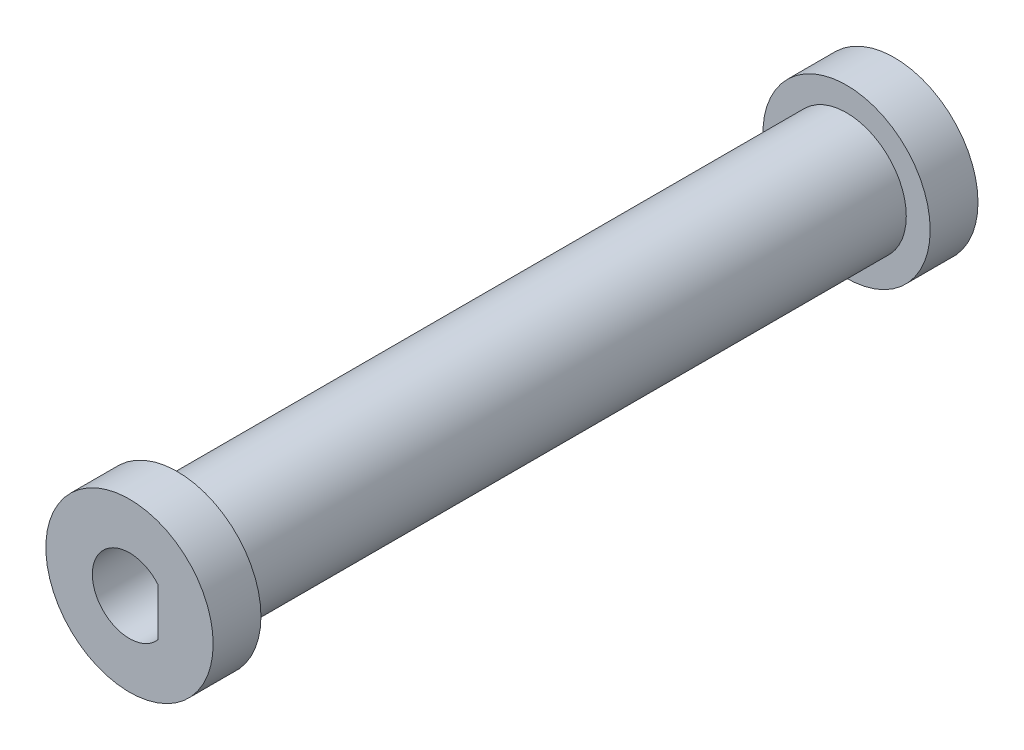
ISO-10303-21;
HEADER;
FILE_DESCRIPTION(('STEP AP214'),'2;1');
FILE_NAME('part.step','',(''),(''),'','','');
FILE_SCHEMA(('AUTOMOTIVE_DESIGN { 1 0 10303 214 1 1 1 1 }'));
ENDSEC;
DATA;
#1=APPLICATION_CONTEXT('core data for automotive mechanical design processes');
#2=APPLICATION_PROTOCOL_DEFINITION('international standard','automotive_design',2000,#1);
#3=PRODUCT_CONTEXT('',#1,'mechanical');
#4=PRODUCT('Part','Part','',(#3));
#5=PRODUCT_RELATED_PRODUCT_CATEGORY('part','',(#4));
#6=PRODUCT_DEFINITION_FORMATION('','',#4);
#7=PRODUCT_DEFINITION_CONTEXT('part definition',#1,'design');
#8=PRODUCT_DEFINITION('design','',#6,#7);
#9=PRODUCT_DEFINITION_SHAPE('','',#8);
#10=(LENGTH_UNIT() NAMED_UNIT(*) SI_UNIT(.MILLI.,.METRE.));
#11=(NAMED_UNIT(*) PLANE_ANGLE_UNIT() SI_UNIT($,.RADIAN.));
#12=(NAMED_UNIT(*) SI_UNIT($,.STERADIAN.) SOLID_ANGLE_UNIT());
#13=UNCERTAINTY_MEASURE_WITH_UNIT(LENGTH_MEASURE(1.E-05),#10,'distance_accuracy_value','');
#14=(GEOMETRIC_REPRESENTATION_CONTEXT(3) GLOBAL_UNCERTAINTY_ASSIGNED_CONTEXT((#13)) GLOBAL_UNIT_ASSIGNED_CONTEXT((#10,
#11,#12)) REPRESENTATION_CONTEXT('',''));
#15=CARTESIAN_POINT('',(0.,0.,0.));
#16=DIRECTION('',(0.,0.,1.));
#17=DIRECTION('',(1.,0.,0.));
#18=AXIS2_PLACEMENT_3D('',#15,#16,#17);
#19=CARTESIAN_POINT('',(0.,0.,38.1));
#20=DIRECTION('',(0.,0.,1.));
#21=DIRECTION('',(1.,0.,0.));
#22=AXIS2_PLACEMENT_3D('',#19,#20,#21);
#23=PLANE('',#22);
#24=CARTESIAN_POINT('',(0.,0.,38.1));
#25=DIRECTION('',(0.,0.,1.));
#26=DIRECTION('',(1.,0.,0.));
#27=AXIS2_PLACEMENT_3D('',#24,#25,#26);
#28=CIRCLE('',#27,4.445);
#29=CARTESIAN_POINT('',(4.445,0.,38.1));
#30=VERTEX_POINT('',#29);
#31=EDGE_CURVE('E46',#30,#30,#28,.T.);
#32=ORIENTED_EDGE('',*,*,#31,.T.);
#33=EDGE_LOOP('',(#32));
#34=FACE_BOUND('',#33,.T.);
#35=CARTESIAN_POINT('',(0.,0.,38.1));
#36=DIRECTION('',(0.,0.,1.));
#37=DIRECTION('',(1.,0.,0.));
#38=AXIS2_PLACEMENT_3D('',#35,#36,#37);
#39=CIRCLE('',#38,1.975);
#40=CARTESIAN_POINT('',(1.52499999999998,1.25499003980112,38.1));
#41=VERTEX_POINT('',#40);
#42=CARTESIAN_POINT('',(1.52499999999998,-1.25499003980109,38.1));
#43=VERTEX_POINT('',#42);
#44=EDGE_CURVE('E73',#41,#43,#39,.T.);
#45=ORIENTED_EDGE('',*,*,#44,.F.);
#46=DIRECTION('',(0.,-1.,0.));
#47=VECTOR('',#46,1.);
#48=CARTESIAN_POINT('',(1.52499999999998,0.,38.1));
#49=LINE('',#48,#47);
#50=EDGE_CURVE('E68',#41,#43,#49,.T.);
#51=ORIENTED_EDGE('',*,*,#50,.T.);
#52=EDGE_LOOP('',(#45,#51));
#53=FACE_BOUND('',#52,.T.);
#54=ADVANCED_FACE('F37',(#34,#53),#23,.T.);
#55=CARTESIAN_POINT('',(0.,0.,35.56));
#56=DIRECTION('',(0.,0.,-1.));
#57=DIRECTION('',(-1.,0.,0.));
#58=AXIS2_PLACEMENT_3D('',#55,#56,#57);
#59=CYLINDRICAL_SURFACE('',#58,3.175);
#60=CARTESIAN_POINT('',(0.,0.,35.56));
#61=DIRECTION('',(0.,0.,1.));
#62=DIRECTION('',(1.,0.,0.));
#63=AXIS2_PLACEMENT_3D('',#60,#61,#62);
#64=CIRCLE('',#63,3.175);
#65=CARTESIAN_POINT('',(3.175,0.,35.56));
#66=VERTEX_POINT('',#65);
#67=EDGE_CURVE('E11',#66,#66,#64,.T.);
#68=ORIENTED_EDGE('',*,*,#67,.F.);
#69=EDGE_LOOP('',(#68));
#70=FACE_BOUND('',#69,.T.);
#71=CARTESIAN_POINT('',(0.,0.,0.));
#72=DIRECTION('',(0.,0.,1.));
#73=DIRECTION('',(1.,0.,0.));
#74=AXIS2_PLACEMENT_3D('',#71,#72,#73);
#75=CIRCLE('',#74,3.175);
#76=CARTESIAN_POINT('',(3.175,0.,0.));
#77=VERTEX_POINT('',#76);
#78=EDGE_CURVE('E41',#77,#77,#75,.T.);
#79=ORIENTED_EDGE('',*,*,#78,.T.);
#80=EDGE_LOOP('',(#79));
#81=FACE_BOUND('',#80,.T.);
#82=ADVANCED_FACE('F39',(#70,#81),#59,.T.);
#83=CARTESIAN_POINT('',(0.,0.,38.1));
#84=DIRECTION('',(0.,0.,-1.));
#85=DIRECTION('',(-1.,0.,0.));
#86=AXIS2_PLACEMENT_3D('',#83,#84,#85);
#87=CYLINDRICAL_SURFACE('',#86,4.445);
#88=ORIENTED_EDGE('',*,*,#31,.F.);
#89=EDGE_LOOP('',(#88));
#90=FACE_BOUND('',#89,.T.);
#91=CARTESIAN_POINT('',(0.,0.,35.56));
#92=DIRECTION('',(0.,0.,1.));
#93=DIRECTION('',(1.,0.,0.));
#94=AXIS2_PLACEMENT_3D('',#91,#92,#93);
#95=CIRCLE('',#94,4.445);
#96=CARTESIAN_POINT('',(4.445,0.,35.56));
#97=VERTEX_POINT('',#96);
#98=EDGE_CURVE('E90',#97,#97,#95,.T.);
#99=ORIENTED_EDGE('',*,*,#98,.T.);
#100=EDGE_LOOP('',(#99));
#101=FACE_BOUND('',#100,.T.);
#102=ADVANCED_FACE('F116',(#90,#101),#87,.T.);
#103=CARTESIAN_POINT('',(0.,0.,35.56));
#104=DIRECTION('',(0.,0.,1.));
#105=DIRECTION('',(1.,0.,0.));
#106=AXIS2_PLACEMENT_3D('',#103,#104,#105);
#107=PLANE('',#106);
#108=ORIENTED_EDGE('',*,*,#67,.T.);
#109=EDGE_LOOP('',(#108));
#110=FACE_BOUND('',#109,.T.);
#111=ORIENTED_EDGE('',*,*,#98,.F.);
#112=EDGE_LOOP('',(#111));
#113=FACE_BOUND('',#112,.T.);
#114=ADVANCED_FACE('F107',(#110,#113),#107,.F.);
#115=CARTESIAN_POINT('',(0.,0.,-2.54));
#116=DIRECTION('',(0.,0.,1.));
#117=DIRECTION('',(1.,0.,0.));
#118=AXIS2_PLACEMENT_3D('',#115,#116,#117);
#119=CYLINDRICAL_SURFACE('',#118,4.445);
#120=CARTESIAN_POINT('',(0.,0.,-2.54));
#121=DIRECTION('',(0.,0.,1.));
#122=DIRECTION('',(1.,0.,0.));
#123=AXIS2_PLACEMENT_3D('',#120,#121,#122);
#124=CIRCLE('',#123,4.445);
#125=CARTESIAN_POINT('',(4.445,0.,-2.54));
#126=VERTEX_POINT('',#125);
#127=EDGE_CURVE('E83',#126,#126,#124,.T.);
#128=ORIENTED_EDGE('',*,*,#127,.T.);
#129=EDGE_LOOP('',(#128));
#130=FACE_BOUND('',#129,.T.);
#131=CARTESIAN_POINT('',(0.,0.,0.));
#132=DIRECTION('',(0.,0.,1.));
#133=DIRECTION('',(1.,0.,0.));
#134=AXIS2_PLACEMENT_3D('',#131,#132,#133);
#135=CIRCLE('',#134,4.445);
#136=CARTESIAN_POINT('',(4.445,0.,0.));
#137=VERTEX_POINT('',#136);
#138=EDGE_CURVE('E71',#137,#137,#135,.T.);
#139=ORIENTED_EDGE('',*,*,#138,.F.);
#140=EDGE_LOOP('',(#139));
#141=FACE_BOUND('',#140,.T.);
#142=ADVANCED_FACE('F105',(#130,#141),#119,.T.);
#143=CARTESIAN_POINT('',(0.,0.,-2.54));
#144=DIRECTION('',(0.,0.,-1.));
#145=DIRECTION('',(1.,0.,0.));
#146=AXIS2_PLACEMENT_3D('',#143,#144,#145);
#147=PLANE('',#146);
#148=ORIENTED_EDGE('',*,*,#127,.F.);
#149=EDGE_LOOP('',(#148));
#150=FACE_BOUND('',#149,.T.);
#151=ADVANCED_FACE('F101',(#150),#147,.T.);
#152=CARTESIAN_POINT('',(0.,0.,0.));
#153=DIRECTION('',(0.,0.,-1.));
#154=DIRECTION('',(1.,0.,0.));
#155=AXIS2_PLACEMENT_3D('',#152,#153,#154);
#156=PLANE('',#155);
#157=ORIENTED_EDGE('',*,*,#78,.F.);
#158=EDGE_LOOP('',(#157));
#159=FACE_BOUND('',#158,.T.);
#160=ORIENTED_EDGE('',*,*,#138,.T.);
#161=EDGE_LOOP('',(#160));
#162=FACE_BOUND('',#161,.T.);
#163=ADVANCED_FACE('F98',(#159,#162),#156,.F.);
#164=CARTESIAN_POINT('',(1.52499999999998,0.,27.94));
#165=DIRECTION('',(-1.,0.,0.));
#166=DIRECTION('',(0.,0.,1.));
#167=AXIS2_PLACEMENT_3D('',#164,#165,#166);
#168=PLANE('',#167);
#169=ORIENTED_EDGE('',*,*,#50,.F.);
#170=DIRECTION('',(0.,0.,1.));
#171=VECTOR('',#170,1.);
#172=CARTESIAN_POINT('',(1.52499999999997,1.25499003980112,27.94));
#173=LINE('',#172,#171);
#174=CARTESIAN_POINT('',(1.52499999999997,1.25499003980112,27.94));
#175=VERTEX_POINT('',#174);
#176=EDGE_CURVE('E53',#175,#41,#173,.T.);
#177=ORIENTED_EDGE('',*,*,#176,.F.);
#178=DIRECTION('',(0.,1.,0.));
#179=VECTOR('',#178,1.);
#180=CARTESIAN_POINT('',(1.52499999999998,0.,27.94));
#181=LINE('',#180,#179);
#182=CARTESIAN_POINT('',(1.52499999999998,-1.25499003980109,27.94));
#183=VERTEX_POINT('',#182);
#184=EDGE_CURVE('E61',#183,#175,#181,.T.);
#185=ORIENTED_EDGE('',*,*,#184,.F.);
#186=DIRECTION('',(0.,0.,1.));
#187=VECTOR('',#186,1.);
#188=CARTESIAN_POINT('',(1.52499999999998,-1.25499003980109,27.94));
#189=LINE('',#188,#187);
#190=EDGE_CURVE('E65',#183,#43,#189,.T.);
#191=ORIENTED_EDGE('',*,*,#190,.T.);
#192=EDGE_LOOP('',(#169,#177,#185,#191));
#193=FACE_BOUND('',#192,.T.);
#194=ADVANCED_FACE('F66',(#193),#168,.T.);
#195=CARTESIAN_POINT('',(0.,0.,27.94));
#196=DIRECTION('',(0.,0.,1.));
#197=DIRECTION('',(1.,0.,0.));
#198=AXIS2_PLACEMENT_3D('',#195,#196,#197);
#199=CYLINDRICAL_SURFACE('',#198,1.975);
#200=ORIENTED_EDGE('',*,*,#44,.T.);
#201=ORIENTED_EDGE('',*,*,#190,.F.);
#202=CARTESIAN_POINT('',(0.,0.,27.94));
#203=DIRECTION('',(0.,0.,1.));
#204=DIRECTION('',(1.,0.,0.));
#205=AXIS2_PLACEMENT_3D('',#202,#203,#204);
#206=CIRCLE('',#205,1.975);
#207=EDGE_CURVE('E78',#175,#183,#206,.T.);
#208=ORIENTED_EDGE('',*,*,#207,.F.);
#209=ORIENTED_EDGE('',*,*,#176,.T.);
#210=EDGE_LOOP('',(#200,#201,#208,#209));
#211=FACE_BOUND('',#210,.T.);
#212=ADVANCED_FACE('F74',(#211),#199,.F.);
#213=CARTESIAN_POINT('',(0.,0.,27.94));
#214=DIRECTION('',(0.,0.,1.));
#215=DIRECTION('',(1.,0.,0.));
#216=AXIS2_PLACEMENT_3D('',#213,#214,#215);
#217=PLANE('',#216);
#218=ORIENTED_EDGE('',*,*,#184,.T.);
#219=ORIENTED_EDGE('',*,*,#207,.T.);
#220=EDGE_LOOP('',(#218,#219));
#221=FACE_BOUND('',#220,.T.);
#222=ADVANCED_FACE('F165',(#221),#217,.T.);
#223=CLOSED_SHELL('',(#54,#82,#102,#114,#142,#151,#163,#194,#212,#222));
#224=MANIFOLD_SOLID_BREP('B2',#223);
#225=ADVANCED_BREP_SHAPE_REPRESENTATION('',(#18,#224),#14);
#226=SHAPE_DEFINITION_REPRESENTATION(#9,#225);
ENDSEC;
END-ISO-10303-21;
